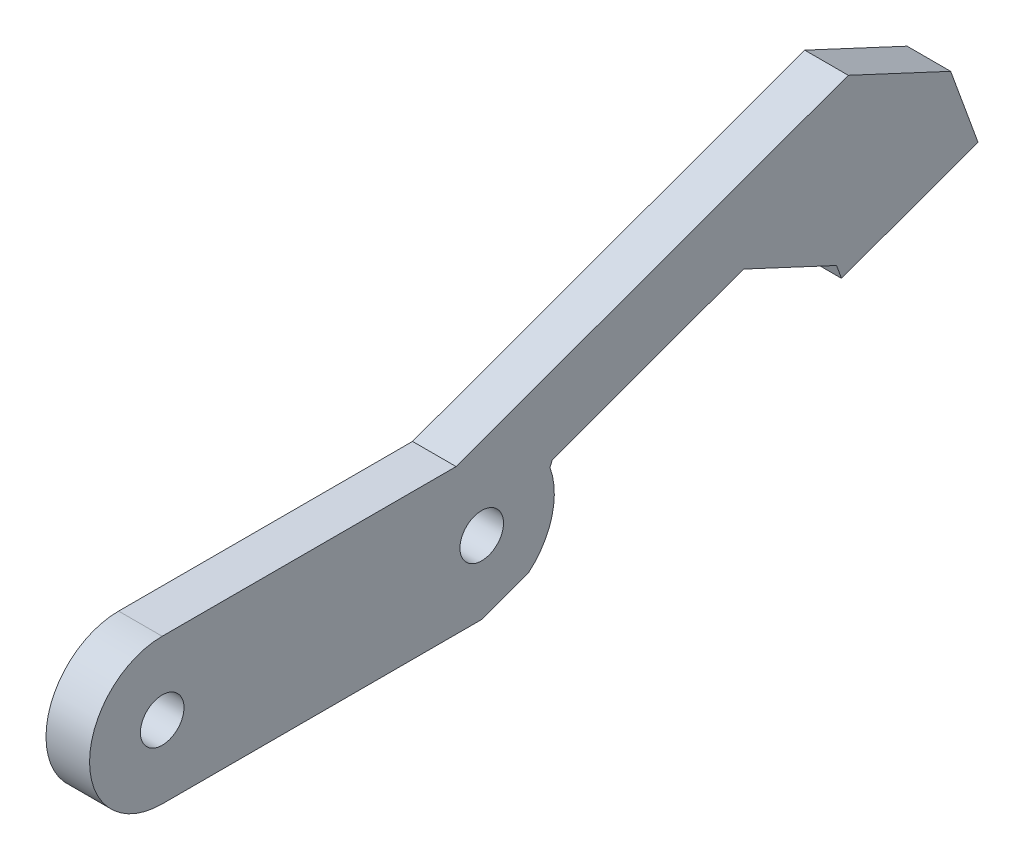
ISO-10303-21;
HEADER;
FILE_DESCRIPTION(('STEP AP214'),'2;1');
FILE_NAME('part.step','',(''),(''),'','','');
FILE_SCHEMA(('AUTOMOTIVE_DESIGN { 1 0 10303 214 1 1 1 1 }'));
ENDSEC;
DATA;
#1=APPLICATION_CONTEXT('core data for automotive mechanical design processes');
#2=APPLICATION_PROTOCOL_DEFINITION('international standard','automotive_design',2000,#1);
#3=PRODUCT_CONTEXT('',#1,'mechanical');
#4=PRODUCT('Part','Part','',(#3));
#5=PRODUCT_RELATED_PRODUCT_CATEGORY('part','',(#4));
#6=PRODUCT_DEFINITION_FORMATION('','',#4);
#7=PRODUCT_DEFINITION_CONTEXT('part definition',#1,'design');
#8=PRODUCT_DEFINITION('design','',#6,#7);
#9=PRODUCT_DEFINITION_SHAPE('','',#8);
#10=(LENGTH_UNIT() NAMED_UNIT(*) SI_UNIT(.MILLI.,.METRE.));
#11=(NAMED_UNIT(*) PLANE_ANGLE_UNIT() SI_UNIT($,.RADIAN.));
#12=(NAMED_UNIT(*) SI_UNIT($,.STERADIAN.) SOLID_ANGLE_UNIT());
#13=UNCERTAINTY_MEASURE_WITH_UNIT(LENGTH_MEASURE(1.E-05),#10,'distance_accuracy_value','');
#14=(GEOMETRIC_REPRESENTATION_CONTEXT(3) GLOBAL_UNCERTAINTY_ASSIGNED_CONTEXT((#13)) GLOBAL_UNIT_ASSIGNED_CONTEXT((#10,
#11,#12)) REPRESENTATION_CONTEXT('',''));
#15=CARTESIAN_POINT('',(0.,0.,0.));
#16=DIRECTION('',(0.,0.,1.));
#17=DIRECTION('',(1.,0.,0.));
#18=AXIS2_PLACEMENT_3D('',#15,#16,#17);
#19=CARTESIAN_POINT('',(3.,5.,-27.));
#20=DIRECTION('',(-1.,0.,0.));
#21=DIRECTION('',(0.,0.,1.));
#22=AXIS2_PLACEMENT_3D('',#19,#20,#21);
#23=CYLINDRICAL_SURFACE('',#22,5.);
#24=CARTESIAN_POINT('',(3.,5.,-27.));
#25=DIRECTION('',(1.,0.,0.));
#26=DIRECTION('',(0.,0.,-1.));
#27=AXIS2_PLACEMENT_3D('',#24,#25,#26);
#28=CIRCLE('',#27,5.);
#29=CARTESIAN_POINT('',(3.,1.16977778440544,-30.2139380484331));
#30=VERTEX_POINT('',#29);
#31=CARTESIAN_POINT('',(3.,6.72101917691477,-31.6944747302219));
#32=VERTEX_POINT('',#31);
#33=EDGE_CURVE('E132',#30,#32,#28,.T.);
#34=ORIENTED_EDGE('',*,*,#33,.F.);
#35=DIRECTION('',(1.,0.,0.));
#36=VECTOR('',#35,1.);
#37=CARTESIAN_POINT('',(0.,1.16977778440544,-30.2139380484331));
#38=LINE('',#37,#36);
#39=CARTESIAN_POINT('',(0.,1.16977778440544,-30.2139380484331));
#40=VERTEX_POINT('',#39);
#41=EDGE_CURVE('E101',#40,#30,#38,.T.);
#42=ORIENTED_EDGE('',*,*,#41,.F.);
#43=CARTESIAN_POINT('',(0.,5.,-27.));
#44=DIRECTION('',(1.,0.,0.));
#45=DIRECTION('',(0.,0.,-1.));
#46=AXIS2_PLACEMENT_3D('',#43,#44,#45);
#47=CIRCLE('',#46,5.);
#48=CARTESIAN_POINT('',(0.,6.72101917691477,-31.6944747302219));
#49=VERTEX_POINT('',#48);
#50=EDGE_CURVE('E100',#40,#49,#47,.T.);
#51=ORIENTED_EDGE('',*,*,#50,.T.);
#52=DIRECTION('',(1.,0.,0.));
#53=VECTOR('',#52,1.);
#54=CARTESIAN_POINT('',(0.,6.72101917691477,-31.6944747302219));
#55=LINE('',#54,#53);
#56=EDGE_CURVE('E144',#49,#32,#55,.T.);
#57=ORIENTED_EDGE('',*,*,#56,.T.);
#58=EDGE_LOOP('',(#34,#42,#51,#57));
#59=FACE_BOUND('',#58,.T.);
#60=ADVANCED_FACE('F34',(#59),#23,.T.);
#61=CARTESIAN_POINT('',(3.,10.,-42.2186144567226));
#62=DIRECTION('',(0.,1.,0.));
#63=DIRECTION('',(0.,0.,1.));
#64=AXIS2_PLACEMENT_3D('',#61,#62,#63);
#65=PLANE('',#64);
#66=DIRECTION('',(1.,0.,0.));
#67=VECTOR('',#66,1.);
#68=CARTESIAN_POINT('',(0.,10.,-25.2367301929158));
#69=LINE('',#68,#67);
#70=CARTESIAN_POINT('',(0.,10.,-25.2367301929158));
#71=VERTEX_POINT('',#70);
#72=CARTESIAN_POINT('',(3.,10.,-25.2367301929158));
#73=VERTEX_POINT('',#72);
#74=EDGE_CURVE('E153',#71,#73,#69,.T.);
#75=ORIENTED_EDGE('',*,*,#74,.F.);
#76=DIRECTION('',(0.,0.,-1.));
#77=VECTOR('',#76,1.);
#78=CARTESIAN_POINT('',(0.,10.,-42.2186144567226));
#79=LINE('',#78,#77);
#80=CARTESIAN_POINT('',(0.,10.,-5.));
#81=VERTEX_POINT('',#80);
#82=EDGE_CURVE('E109',#81,#71,#79,.T.);
#83=ORIENTED_EDGE('',*,*,#82,.F.);
#84=DIRECTION('',(-1.,0.,0.));
#85=VECTOR('',#84,1.);
#86=CARTESIAN_POINT('',(3.,10.,-5.));
#87=LINE('',#86,#85);
#88=CARTESIAN_POINT('',(3.,10.,-5.));
#89=VERTEX_POINT('',#88);
#90=EDGE_CURVE('E11',#89,#81,#87,.T.);
#91=ORIENTED_EDGE('',*,*,#90,.F.);
#92=DIRECTION('',(0.,0.,-1.));
#93=VECTOR('',#92,1.);
#94=CARTESIAN_POINT('',(3.,10.,-42.2186144567226));
#95=LINE('',#94,#93);
#96=EDGE_CURVE('E117',#89,#73,#95,.T.);
#97=ORIENTED_EDGE('',*,*,#96,.T.);
#98=EDGE_LOOP('',(#75,#83,#91,#97));
#99=FACE_BOUND('',#98,.T.);
#100=ADVANCED_FACE('F36',(#99),#65,.T.);
#101=CARTESIAN_POINT('',(3.,5.,-5.));
#102=DIRECTION('',(-1.,0.,0.));
#103=DIRECTION('',(0.,0.,1.));
#104=AXIS2_PLACEMENT_3D('',#101,#102,#103);
#105=CYLINDRICAL_SURFACE('',#104,5.);
#106=CARTESIAN_POINT('',(0.,5.,-5.));
#107=DIRECTION('',(1.,0.,0.));
#108=DIRECTION('',(0.,0.,-1.));
#109=AXIS2_PLACEMENT_3D('',#106,#107,#108);
#110=CIRCLE('',#109,5.);
#111=CARTESIAN_POINT('',(0.,0.,-5.));
#112=VERTEX_POINT('',#111);
#113=EDGE_CURVE('E105',#81,#112,#110,.T.);
#114=ORIENTED_EDGE('',*,*,#113,.T.);
#115=DIRECTION('',(-1.,0.,0.));
#116=VECTOR('',#115,1.);
#117=CARTESIAN_POINT('',(3.,0.,-5.));
#118=LINE('',#117,#116);
#119=CARTESIAN_POINT('',(3.,0.,-5.));
#120=VERTEX_POINT('',#119);
#121=EDGE_CURVE('E42',#120,#112,#118,.T.);
#122=ORIENTED_EDGE('',*,*,#121,.F.);
#123=CARTESIAN_POINT('',(3.,5.,-5.));
#124=DIRECTION('',(1.,0.,0.));
#125=DIRECTION('',(0.,0.,-1.));
#126=AXIS2_PLACEMENT_3D('',#123,#124,#125);
#127=CIRCLE('',#126,5.);
#128=EDGE_CURVE('E58',#89,#120,#127,.T.);
#129=ORIENTED_EDGE('',*,*,#128,.F.);
#130=ORIENTED_EDGE('',*,*,#90,.T.);
#131=EDGE_LOOP('',(#114,#122,#129,#130));
#132=FACE_BOUND('',#131,.T.);
#133=ADVANCED_FACE('F289',(#132),#105,.T.);
#134=CARTESIAN_POINT('',(3.,0.,-42.2186144567226));
#135=DIRECTION('',(0.,1.,0.));
#136=DIRECTION('',(0.,0.,1.));
#137=AXIS2_PLACEMENT_3D('',#134,#135,#136);
#138=PLANE('',#137);
#139=DIRECTION('',(0.,0.,-1.));
#140=VECTOR('',#139,1.);
#141=CARTESIAN_POINT('',(0.,0.,-42.2186144567226));
#142=LINE('',#141,#140);
#143=CARTESIAN_POINT('',(0.,0.,-27.));
#144=VERTEX_POINT('',#143);
#145=EDGE_CURVE('E97',#112,#144,#142,.T.);
#146=ORIENTED_EDGE('',*,*,#145,.T.);
#147=DIRECTION('',(-1.,0.,0.));
#148=VECTOR('',#147,1.);
#149=CARTESIAN_POINT('',(3.,0.,-27.));
#150=LINE('',#149,#148);
#151=CARTESIAN_POINT('',(3.,0.,-27.));
#152=VERTEX_POINT('',#151);
#153=EDGE_CURVE('E75',#152,#144,#150,.T.);
#154=ORIENTED_EDGE('',*,*,#153,.F.);
#155=DIRECTION('',(0.,0.,-1.));
#156=VECTOR('',#155,1.);
#157=CARTESIAN_POINT('',(3.,0.,-42.2186144567226));
#158=LINE('',#157,#156);
#159=EDGE_CURVE('E125',#120,#152,#158,.T.);
#160=ORIENTED_EDGE('',*,*,#159,.F.);
#161=ORIENTED_EDGE('',*,*,#121,.T.);
#162=EDGE_LOOP('',(#146,#154,#160,#161));
#163=FACE_BOUND('',#162,.T.);
#164=ADVANCED_FACE('F104',(#163),#138,.F.);
#165=CARTESIAN_POINT('',(3.,5.,-5.));
#166=DIRECTION('',(-1.,0.,0.));
#167=DIRECTION('',(0.,0.,1.));
#168=AXIS2_PLACEMENT_3D('',#165,#166,#167);
#169=CYLINDRICAL_SURFACE('',#168,1.5);
#170=CARTESIAN_POINT('',(3.,5.,-5.));
#171=DIRECTION('',(1.,0.,0.));
#172=DIRECTION('',(0.,0.,-1.));
#173=AXIS2_PLACEMENT_3D('',#170,#171,#172);
#174=CIRCLE('',#173,1.5);
#175=CARTESIAN_POINT('',(3.,5.,-6.5));
#176=VERTEX_POINT('',#175);
#177=EDGE_CURVE('E135',#176,#176,#174,.T.);
#178=ORIENTED_EDGE('',*,*,#177,.T.);
#179=EDGE_LOOP('',(#178));
#180=FACE_BOUND('',#179,.T.);
#181=CARTESIAN_POINT('',(0.,5.,-5.));
#182=DIRECTION('',(1.,0.,0.));
#183=DIRECTION('',(0.,0.,-1.));
#184=AXIS2_PLACEMENT_3D('',#181,#182,#183);
#185=CIRCLE('',#184,1.5);
#186=CARTESIAN_POINT('',(0.,5.,-6.5));
#187=VERTEX_POINT('',#186);
#188=EDGE_CURVE('E107',#187,#187,#185,.T.);
#189=ORIENTED_EDGE('',*,*,#188,.F.);
#190=EDGE_LOOP('',(#189));
#191=FACE_BOUND('',#190,.T.);
#192=ADVANCED_FACE('F292',(#180,#191),#169,.F.);
#193=CARTESIAN_POINT('',(3.,5.,-27.));
#194=DIRECTION('',(-1.,0.,0.));
#195=DIRECTION('',(0.,0.,1.));
#196=AXIS2_PLACEMENT_3D('',#193,#194,#195);
#197=CYLINDRICAL_SURFACE('',#196,1.5);
#198=CARTESIAN_POINT('',(3.,5.,-27.));
#199=DIRECTION('',(1.,0.,0.));
#200=DIRECTION('',(0.,0.,-1.));
#201=AXIS2_PLACEMENT_3D('',#198,#199,#200);
#202=CIRCLE('',#201,1.5);
#203=CARTESIAN_POINT('',(3.,5.,-28.5));
#204=VERTEX_POINT('',#203);
#205=EDGE_CURVE('E88',#204,#204,#202,.T.);
#206=ORIENTED_EDGE('',*,*,#205,.T.);
#207=EDGE_LOOP('',(#206));
#208=FACE_BOUND('',#207,.T.);
#209=CARTESIAN_POINT('',(0.,5.,-27.));
#210=DIRECTION('',(1.,0.,0.));
#211=DIRECTION('',(0.,0.,-1.));
#212=AXIS2_PLACEMENT_3D('',#209,#210,#211);
#213=CIRCLE('',#212,1.5);
#214=CARTESIAN_POINT('',(0.,5.,-28.5));
#215=VERTEX_POINT('',#214);
#216=EDGE_CURVE('E115',#215,#215,#213,.T.);
#217=ORIENTED_EDGE('',*,*,#216,.F.);
#218=EDGE_LOOP('',(#217));
#219=FACE_BOUND('',#218,.T.);
#220=ADVANCED_FACE('F318',(#208,#219),#197,.F.);
#221=CARTESIAN_POINT('',(3.,5.,-42.2186144567226));
#222=DIRECTION('',(1.,0.,0.));
#223=DIRECTION('',(0.,0.,-1.));
#224=AXIS2_PLACEMENT_3D('',#221,#222,#223);
#225=PLANE('',#224);
#226=DIRECTION('',(0.,-0.422618261740699,-0.90630778703665));
#227=VECTOR('',#226,1.);
#228=CARTESIAN_POINT('',(3.,7.12812178730442,-79.4765594935005));
#229=LINE('',#228,#227);
#230=CARTESIAN_POINT('',(3.,19.828540579292,-52.2404235007135));
#231=VERTEX_POINT('',#230);
#232=CARTESIAN_POINT('',(3.,16.5413419532607,-59.2898437033272));
#233=VERTEX_POINT('',#232);
#234=EDGE_CURVE('E49',#231,#233,#229,.T.);
#235=ORIENTED_EDGE('',*,*,#234,.F.);
#236=DIRECTION('',(0.,-0.342020143325674,0.939692620785907));
#237=VECTOR('',#236,1.);
#238=CARTESIAN_POINT('',(3.,28.7351753723726,-76.7112014780308));
#239=LINE('',#238,#237);
#240=EDGE_CURVE('E205',#231,#73,#239,.T.);
#241=ORIENTED_EDGE('',*,*,#240,.T.);
#242=ORIENTED_EDGE('',*,*,#96,.F.);
#243=ORIENTED_EDGE('',*,*,#128,.T.);
#244=ORIENTED_EDGE('',*,*,#159,.T.);
#245=DIRECTION('',(0.,-0.342020143325663,0.939692620785911));
#246=VECTOR('',#245,1.);
#247=CARTESIAN_POINT('',(3.,18.6939296367721,-78.3611495579052));
#248=LINE('',#247,#246);
#249=EDGE_CURVE('E84',#30,#152,#248,.T.);
#250=ORIENTED_EDGE('',*,*,#249,.F.);
#251=ORIENTED_EDGE('',*,*,#33,.T.);
#252=DIRECTION('',(0.,-0.906307787036649,0.422618261740702));
#253=VECTOR('',#252,1.);
#254=CARTESIAN_POINT('',(3.,27.2089943139524,-41.2481744367118));
#255=LINE('',#254,#253);
#256=CARTESIAN_POINT('',(3.,7.09260410720915,-31.8677476288731));
#257=VERTEX_POINT('',#256);
#258=EDGE_CURVE('E156',#257,#32,#255,.T.);
#259=ORIENTED_EDGE('',*,*,#258,.F.);
#260=DIRECTION('',(0.,0.342020143325674,-0.939692620785907));
#261=VECTOR('',#260,1.);
#262=CARTESIAN_POINT('',(3.,24.036712268443,-78.4213021946592));
#263=LINE('',#262,#261);
#264=CARTESIAN_POINT('',(3.,11.8808861137686,-45.0234443198758));
#265=VERTEX_POINT('',#264);
#266=EDGE_CURVE('E191',#257,#265,#263,.T.);
#267=ORIENTED_EDGE('',*,*,#266,.T.);
#268=DIRECTION('',(0.,-0.4226182617407,-0.90630778703665));
#269=VECTOR('',#268,1.);
#270=CARTESIAN_POINT('',(3.,-4.16442614072387,-79.4327274913717));
#271=LINE('',#270,#269);
#272=CARTESIAN_POINT('',(3.,8.89252372646743,-51.4320081404336));
#273=VERTEX_POINT('',#272);
#274=EDGE_CURVE('E194',#265,#273,#271,.T.);
#275=ORIENTED_EDGE('',*,*,#274,.T.);
#276=DIRECTION('',(0.,-0.939692620785908,-0.34202014332567));
#277=VECTOR('',#276,1.);
#278=CARTESIAN_POINT('',(3.,-3.46575072080786,-55.9300521861344));
#279=LINE('',#278,#277);
#280=CARTESIAN_POINT('',(3.,7.95283110568152,-51.7740282837593));
#281=VERTEX_POINT('',#280);
#282=EDGE_CURVE('E197',#273,#281,#279,.T.);
#283=ORIENTED_EDGE('',*,*,#282,.T.);
#284=DIRECTION('',(0.,0.34202014332567,-0.939692620785908));
#285=VECTOR('',#284,1.);
#286=CARTESIAN_POINT('',(3.,18.3985565437275,-80.4734230546133));
#287=LINE('',#286,#285);
#288=CARTESIAN_POINT('',(3.,11.3730325389382,-61.1709544916184));
#289=VERTEX_POINT('',#288);
#290=EDGE_CURVE('E200',#281,#289,#287,.T.);
#291=ORIENTED_EDGE('',*,*,#290,.T.);
#292=DIRECTION('',(0.,0.939692620785907,0.342020143325674));
#293=VECTOR('',#292,1.);
#294=CARTESIAN_POINT('',(3.,-0.0455492875512222,-65.3269783939936));
#295=LINE('',#294,#293);
#296=EDGE_CURVE('E203',#289,#233,#295,.T.);
#297=ORIENTED_EDGE('',*,*,#296,.T.);
#298=EDGE_LOOP('',(#235,#241,#242,#243,#244,#250,#251,#259,#267,#275,#283,#291,#297));
#299=FACE_BOUND('',#298,.T.);
#300=ORIENTED_EDGE('',*,*,#177,.F.);
#301=EDGE_LOOP('',(#300));
#302=FACE_BOUND('',#301,.T.);
#303=ORIENTED_EDGE('',*,*,#205,.F.);
#304=EDGE_LOOP('',(#303));
#305=FACE_BOUND('',#304,.T.);
#306=ADVANCED_FACE('F270',(#299,#302,#305),#225,.T.);
#307=CARTESIAN_POINT('',(0.,5.,-42.2186144567226));
#308=DIRECTION('',(1.,0.,0.));
#309=DIRECTION('',(0.,0.,-1.));
#310=AXIS2_PLACEMENT_3D('',#307,#308,#309);
#311=PLANE('',#310);
#312=DIRECTION('',(0.,-0.342020143325674,0.939692620785907));
#313=VECTOR('',#312,1.);
#314=CARTESIAN_POINT('',(0.,28.7351753723726,-76.7112014780308));
#315=LINE('',#314,#313);
#316=CARTESIAN_POINT('',(0.,19.828540579292,-52.2404235007135));
#317=VERTEX_POINT('',#316);
#318=EDGE_CURVE('E181',#317,#71,#315,.T.);
#319=ORIENTED_EDGE('',*,*,#318,.F.);
#320=DIRECTION('',(0.,-0.422618261740699,-0.90630778703665));
#321=VECTOR('',#320,1.);
#322=CARTESIAN_POINT('',(0.,7.12812178730442,-79.4765594935005));
#323=LINE('',#322,#321);
#324=CARTESIAN_POINT('',(0.,16.5413419532607,-59.2898437033272));
#325=VERTEX_POINT('',#324);
#326=EDGE_CURVE('E239',#317,#325,#323,.T.);
#327=ORIENTED_EDGE('',*,*,#326,.T.);
#328=DIRECTION('',(0.,0.939692620785907,0.342020143325674));
#329=VECTOR('',#328,1.);
#330=CARTESIAN_POINT('',(0.,-0.0455492875512222,-65.3269783939936));
#331=LINE('',#330,#329);
#332=CARTESIAN_POINT('',(0.,11.3730325389382,-61.1709544916184));
#333=VERTEX_POINT('',#332);
#334=EDGE_CURVE('E187',#333,#325,#331,.T.);
#335=ORIENTED_EDGE('',*,*,#334,.F.);
#336=DIRECTION('',(0.,0.34202014332567,-0.939692620785908));
#337=VECTOR('',#336,1.);
#338=CARTESIAN_POINT('',(0.,18.3985565437275,-80.4734230546133));
#339=LINE('',#338,#337);
#340=CARTESIAN_POINT('',(0.,7.95283110568152,-51.7740282837593));
#341=VERTEX_POINT('',#340);
#342=EDGE_CURVE('E220',#341,#333,#339,.T.);
#343=ORIENTED_EDGE('',*,*,#342,.F.);
#344=DIRECTION('',(0.,-0.939692620785908,-0.34202014332567));
#345=VECTOR('',#344,1.);
#346=CARTESIAN_POINT('',(0.,-3.46575072080786,-55.9300521861344));
#347=LINE('',#346,#345);
#348=CARTESIAN_POINT('',(0.,8.89252372646743,-51.4320081404336));
#349=VERTEX_POINT('',#348);
#350=EDGE_CURVE('E213',#349,#341,#347,.T.);
#351=ORIENTED_EDGE('',*,*,#350,.F.);
#352=DIRECTION('',(0.,-0.4226182617407,-0.90630778703665));
#353=VECTOR('',#352,1.);
#354=CARTESIAN_POINT('',(0.,-4.16442614072387,-79.4327274913717));
#355=LINE('',#354,#353);
#356=CARTESIAN_POINT('',(0.,11.8808861137686,-45.0234443198758));
#357=VERTEX_POINT('',#356);
#358=EDGE_CURVE('E210',#357,#349,#355,.T.);
#359=ORIENTED_EDGE('',*,*,#358,.F.);
#360=DIRECTION('',(0.,0.342020143325674,-0.939692620785907));
#361=VECTOR('',#360,1.);
#362=CARTESIAN_POINT('',(0.,24.036712268443,-78.4213021946592));
#363=LINE('',#362,#361);
#364=CARTESIAN_POINT('',(0.,7.09260410720915,-31.8677476288731));
#365=VERTEX_POINT('',#364);
#366=EDGE_CURVE('E208',#365,#357,#363,.T.);
#367=ORIENTED_EDGE('',*,*,#366,.F.);
#368=DIRECTION('',(0.,-0.906307787036649,0.422618261740702));
#369=VECTOR('',#368,1.);
#370=CARTESIAN_POINT('',(0.,27.2089943139524,-41.2481744367118));
#371=LINE('',#370,#369);
#372=EDGE_CURVE('E175',#365,#49,#371,.T.);
#373=ORIENTED_EDGE('',*,*,#372,.T.);
#374=ORIENTED_EDGE('',*,*,#50,.F.);
#375=DIRECTION('',(0.,-0.342020143325663,0.939692620785911));
#376=VECTOR('',#375,1.);
#377=CARTESIAN_POINT('',(0.,18.6939296367721,-78.3611495579052));
#378=LINE('',#377,#376);
#379=EDGE_CURVE('E80',#40,#144,#378,.T.);
#380=ORIENTED_EDGE('',*,*,#379,.T.);
#381=ORIENTED_EDGE('',*,*,#145,.F.);
#382=ORIENTED_EDGE('',*,*,#113,.F.);
#383=ORIENTED_EDGE('',*,*,#82,.T.);
#384=EDGE_LOOP('',(#319,#327,#335,#343,#351,#359,#367,#373,#374,#380,#381,#382,#383));
#385=FACE_BOUND('',#384,.T.);
#386=ORIENTED_EDGE('',*,*,#188,.T.);
#387=EDGE_LOOP('',(#386));
#388=FACE_BOUND('',#387,.T.);
#389=ORIENTED_EDGE('',*,*,#216,.T.);
#390=EDGE_LOOP('',(#389));
#391=FACE_BOUND('',#390,.T.);
#392=ADVANCED_FACE('F94',(#385,#388,#391),#311,.F.);
#393=CARTESIAN_POINT('',(0.,24.036712268443,-78.4213021946592));
#394=DIRECTION('',(0.,-0.939692620785906,-0.342020143325674));
#395=DIRECTION('',(0.,0.342020143325674,-0.939692620785907));
#396=AXIS2_PLACEMENT_3D('',#393,#394,#395);
#397=PLANE('',#396);
#398=ORIENTED_EDGE('',*,*,#266,.F.);
#399=DIRECTION('',(1.,0.,0.));
#400=VECTOR('',#399,1.);
#401=CARTESIAN_POINT('',(0.,7.09260410720915,-31.8677476288731));
#402=LINE('',#401,#400);
#403=EDGE_CURVE('E140',#365,#257,#402,.T.);
#404=ORIENTED_EDGE('',*,*,#403,.F.);
#405=ORIENTED_EDGE('',*,*,#366,.T.);
#406=DIRECTION('',(1.,0.,0.));
#407=VECTOR('',#406,1.);
#408=CARTESIAN_POINT('',(0.,11.8808861137686,-45.0234443198758));
#409=LINE('',#408,#407);
#410=EDGE_CURVE('E128',#357,#265,#409,.T.);
#411=ORIENTED_EDGE('',*,*,#410,.T.);
#412=EDGE_LOOP('',(#398,#404,#405,#411));
#413=FACE_BOUND('',#412,.T.);
#414=ADVANCED_FACE('F308',(#413),#397,.T.);
#415=CARTESIAN_POINT('',(0.,27.2089943139524,-41.2481744367118));
#416=DIRECTION('',(0.,0.422618261740702,0.906307787036649));
#417=DIRECTION('',(0.,-0.906307787036649,0.422618261740702));
#418=AXIS2_PLACEMENT_3D('',#415,#416,#417);
#419=PLANE('',#418);
#420=ORIENTED_EDGE('',*,*,#258,.T.);
#421=ORIENTED_EDGE('',*,*,#56,.F.);
#422=ORIENTED_EDGE('',*,*,#372,.F.);
#423=ORIENTED_EDGE('',*,*,#403,.T.);
#424=EDGE_LOOP('',(#420,#421,#422,#423));
#425=FACE_BOUND('',#424,.T.);
#426=ADVANCED_FACE('F272',(#425),#419,.F.);
#427=CARTESIAN_POINT('',(0.,28.7351753723726,-76.7112014780308));
#428=DIRECTION('',(0.,0.939692620785906,0.342020143325674));
#429=DIRECTION('',(0.,-0.342020143325674,0.939692620785907));
#430=AXIS2_PLACEMENT_3D('',#427,#428,#429);
#431=PLANE('',#430);
#432=DIRECTION('',(1.,0.,0.));
#433=VECTOR('',#432,1.);
#434=CARTESIAN_POINT('',(0.,19.828540579292,-52.2404235007135));
#435=LINE('',#434,#433);
#436=EDGE_CURVE('E302',#317,#231,#435,.T.);
#437=ORIENTED_EDGE('',*,*,#436,.F.);
#438=ORIENTED_EDGE('',*,*,#318,.T.);
#439=ORIENTED_EDGE('',*,*,#74,.T.);
#440=ORIENTED_EDGE('',*,*,#240,.F.);
#441=EDGE_LOOP('',(#437,#438,#439,#440));
#442=FACE_BOUND('',#441,.T.);
#443=ADVANCED_FACE('F301',(#442),#431,.T.);
#444=CARTESIAN_POINT('',(0.,-0.0455492875512222,-65.3269783939936));
#445=DIRECTION('',(0.,0.342020143325674,-0.939692620785906));
#446=DIRECTION('',(0.,0.939692620785907,0.342020143325674));
#447=AXIS2_PLACEMENT_3D('',#444,#445,#446);
#448=PLANE('',#447);
#449=DIRECTION('',(1.,0.,0.));
#450=VECTOR('',#449,1.);
#451=CARTESIAN_POINT('',(0.,16.5413419532607,-59.2898437033272));
#452=LINE('',#451,#450);
#453=EDGE_CURVE('E229',#325,#233,#452,.T.);
#454=ORIENTED_EDGE('',*,*,#453,.T.);
#455=ORIENTED_EDGE('',*,*,#296,.F.);
#456=DIRECTION('',(1.,0.,0.));
#457=VECTOR('',#456,1.);
#458=CARTESIAN_POINT('',(0.,11.3730325389382,-61.1709544916184));
#459=LINE('',#458,#457);
#460=EDGE_CURVE('E161',#333,#289,#459,.T.);
#461=ORIENTED_EDGE('',*,*,#460,.F.);
#462=ORIENTED_EDGE('',*,*,#334,.T.);
#463=EDGE_LOOP('',(#454,#455,#461,#462));
#464=FACE_BOUND('',#463,.T.);
#465=ADVANCED_FACE('F227',(#464),#448,.T.);
#466=CARTESIAN_POINT('',(0.,18.3985565437275,-80.4734230546133));
#467=DIRECTION('',(0.,-0.939692620785908,-0.34202014332567));
#468=DIRECTION('',(0.,0.34202014332567,-0.939692620785908));
#469=AXIS2_PLACEMENT_3D('',#466,#467,#468);
#470=PLANE('',#469);
#471=ORIENTED_EDGE('',*,*,#290,.F.);
#472=DIRECTION('',(1.,0.,0.));
#473=VECTOR('',#472,1.);
#474=CARTESIAN_POINT('',(0.,7.95283110568152,-51.7740282837593));
#475=LINE('',#474,#473);
#476=EDGE_CURVE('E164',#341,#281,#475,.T.);
#477=ORIENTED_EDGE('',*,*,#476,.F.);
#478=ORIENTED_EDGE('',*,*,#342,.T.);
#479=ORIENTED_EDGE('',*,*,#460,.T.);
#480=EDGE_LOOP('',(#471,#477,#478,#479));
#481=FACE_BOUND('',#480,.T.);
#482=ADVANCED_FACE('F244',(#481),#470,.T.);
#483=CARTESIAN_POINT('',(0.,-3.46575072080786,-55.9300521861344));
#484=DIRECTION('',(0.,-0.34202014332567,0.939692620785908));
#485=DIRECTION('',(0.,-0.939692620785908,-0.34202014332567));
#486=AXIS2_PLACEMENT_3D('',#483,#484,#485);
#487=PLANE('',#486);
#488=ORIENTED_EDGE('',*,*,#282,.F.);
#489=DIRECTION('',(1.,0.,0.));
#490=VECTOR('',#489,1.);
#491=CARTESIAN_POINT('',(0.,8.89252372646743,-51.4320081404336));
#492=LINE('',#491,#490);
#493=EDGE_CURVE('E166',#349,#273,#492,.T.);
#494=ORIENTED_EDGE('',*,*,#493,.F.);
#495=ORIENTED_EDGE('',*,*,#350,.T.);
#496=ORIENTED_EDGE('',*,*,#476,.T.);
#497=EDGE_LOOP('',(#488,#494,#495,#496));
#498=FACE_BOUND('',#497,.T.);
#499=ADVANCED_FACE('F250',(#498),#487,.T.);
#500=CARTESIAN_POINT('',(0.,-4.16442614072387,-79.4327274913717));
#501=DIRECTION('',(0.,-0.90630778703665,0.4226182617407));
#502=DIRECTION('',(0.,-0.4226182617407,-0.90630778703665));
#503=AXIS2_PLACEMENT_3D('',#500,#501,#502);
#504=PLANE('',#503);
#505=ORIENTED_EDGE('',*,*,#274,.F.);
#506=ORIENTED_EDGE('',*,*,#410,.F.);
#507=ORIENTED_EDGE('',*,*,#358,.T.);
#508=ORIENTED_EDGE('',*,*,#493,.T.);
#509=EDGE_LOOP('',(#505,#506,#507,#508));
#510=FACE_BOUND('',#509,.T.);
#511=ADVANCED_FACE('F273',(#510),#504,.T.);
#512=CARTESIAN_POINT('',(0.,18.6939296367721,-78.3611495579052));
#513=DIRECTION('',(0.,0.93969262078591,0.342020143325663));
#514=DIRECTION('',(0.,-0.342020143325663,0.93969262078591));
#515=AXIS2_PLACEMENT_3D('',#512,#513,#514);
#516=PLANE('',#515);
#517=ORIENTED_EDGE('',*,*,#249,.T.);
#518=ORIENTED_EDGE('',*,*,#153,.T.);
#519=ORIENTED_EDGE('',*,*,#379,.F.);
#520=ORIENTED_EDGE('',*,*,#41,.T.);
#521=EDGE_LOOP('',(#517,#518,#519,#520));
#522=FACE_BOUND('',#521,.T.);
#523=ADVANCED_FACE('F77',(#522),#516,.F.);
#524=CARTESIAN_POINT('',(0.,7.12812178730442,-79.4765594935005));
#525=DIRECTION('',(0.,-0.90630778703665,0.422618261740699));
#526=DIRECTION('',(0.,-0.422618261740699,-0.90630778703665));
#527=AXIS2_PLACEMENT_3D('',#524,#525,#526);
#528=PLANE('',#527);
#529=ORIENTED_EDGE('',*,*,#234,.T.);
#530=ORIENTED_EDGE('',*,*,#453,.F.);
#531=ORIENTED_EDGE('',*,*,#326,.F.);
#532=ORIENTED_EDGE('',*,*,#436,.T.);
#533=EDGE_LOOP('',(#529,#530,#531,#532));
#534=FACE_BOUND('',#533,.T.);
#535=ADVANCED_FACE('F280',(#534),#528,.F.);
#536=CLOSED_SHELL('',(#60,#100,#133,#164,#192,#220,#306,#392,#414,#426,#443,#465,#482,#499,#511,
#523,#535));
#537=MANIFOLD_SOLID_BREP('B2',#536);
#538=ADVANCED_BREP_SHAPE_REPRESENTATION('',(#18,#537),#14);
#539=SHAPE_DEFINITION_REPRESENTATION(#9,#538);
ENDSEC;
END-ISO-10303-21;
